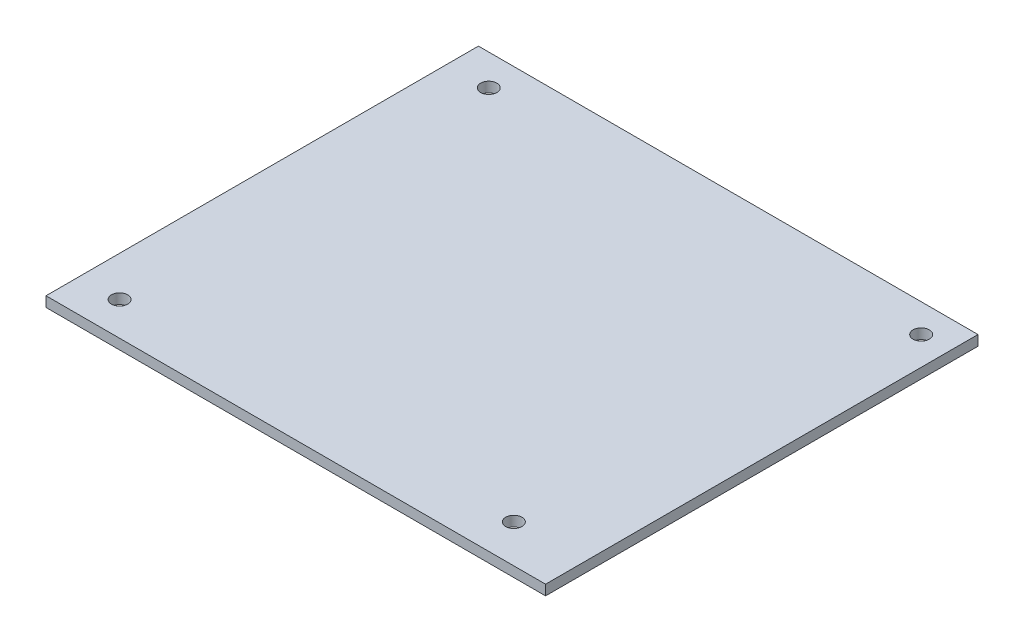
ISO-10303-21;
HEADER;
FILE_DESCRIPTION(('STEP AP214'),'2;1');
FILE_NAME('part.step','',(''),(''),'','','');
FILE_SCHEMA(('AUTOMOTIVE_DESIGN { 1 0 10303 214 1 1 1 1 }'));
ENDSEC;
DATA;
#1=APPLICATION_CONTEXT('core data for automotive mechanical design processes');
#2=APPLICATION_PROTOCOL_DEFINITION('international standard','automotive_design',2000,#1);
#3=PRODUCT_CONTEXT('',#1,'mechanical');
#4=PRODUCT('Part','Part','',(#3));
#5=PRODUCT_RELATED_PRODUCT_CATEGORY('part','',(#4));
#6=PRODUCT_DEFINITION_FORMATION('','',#4);
#7=PRODUCT_DEFINITION_CONTEXT('part definition',#1,'design');
#8=PRODUCT_DEFINITION('design','',#6,#7);
#9=PRODUCT_DEFINITION_SHAPE('','',#8);
#10=(LENGTH_UNIT() NAMED_UNIT(*) SI_UNIT(.MILLI.,.METRE.));
#11=(NAMED_UNIT(*) PLANE_ANGLE_UNIT() SI_UNIT($,.RADIAN.));
#12=(NAMED_UNIT(*) SI_UNIT($,.STERADIAN.) SOLID_ANGLE_UNIT());
#13=UNCERTAINTY_MEASURE_WITH_UNIT(LENGTH_MEASURE(1.E-05),#10,'distance_accuracy_value','');
#14=(GEOMETRIC_REPRESENTATION_CONTEXT(3) GLOBAL_UNCERTAINTY_ASSIGNED_CONTEXT((#13)) GLOBAL_UNIT_ASSIGNED_CONTEXT((#10,
#11,#12)) REPRESENTATION_CONTEXT('',''));
#15=CARTESIAN_POINT('',(0.,0.,0.));
#16=DIRECTION('',(0.,0.,1.));
#17=DIRECTION('',(1.,0.,0.));
#18=AXIS2_PLACEMENT_3D('',#15,#16,#17);
#19=CARTESIAN_POINT('',(0.,2.,0.));
#20=DIRECTION('',(0.,-1.,0.));
#21=DIRECTION('',(0.,0.,-1.));
#22=AXIS2_PLACEMENT_3D('',#19,#20,#21);
#23=PLANE('',#22);
#24=DIRECTION('',(0.,0.,-1.));
#25=VECTOR('',#24,1.);
#26=CARTESIAN_POINT('',(49.149,2.,42.545));
#27=LINE('',#26,#25);
#28=CARTESIAN_POINT('',(49.149,2.,42.545));
#29=VERTEX_POINT('',#28);
#30=CARTESIAN_POINT('',(49.149,2.,-42.545));
#31=VERTEX_POINT('',#30);
#32=EDGE_CURVE('E92',#29,#31,#27,.T.);
#33=ORIENTED_EDGE('',*,*,#32,.T.);
#34=DIRECTION('',(-1.,0.,0.));
#35=VECTOR('',#34,1.);
#36=CARTESIAN_POINT('',(-49.149,2.,-42.545));
#37=LINE('',#36,#35);
#38=CARTESIAN_POINT('',(-49.149,2.,-42.545));
#39=VERTEX_POINT('',#38);
#40=EDGE_CURVE('E87',#31,#39,#37,.T.);
#41=ORIENTED_EDGE('',*,*,#40,.T.);
#42=DIRECTION('',(0.,0.,1.));
#43=VECTOR('',#42,1.);
#44=CARTESIAN_POINT('',(-49.149,2.,42.545));
#45=LINE('',#44,#43);
#46=CARTESIAN_POINT('',(-49.149,2.,42.545));
#47=VERTEX_POINT('',#46);
#48=EDGE_CURVE('E90',#39,#47,#45,.T.);
#49=ORIENTED_EDGE('',*,*,#48,.T.);
#50=DIRECTION('',(1.,0.,0.));
#51=VECTOR('',#50,1.);
#52=CARTESIAN_POINT('',(-49.149,2.,42.545));
#53=LINE('',#52,#51);
#54=EDGE_CURVE('E57',#47,#29,#53,.T.);
#55=ORIENTED_EDGE('',*,*,#54,.T.);
#56=EDGE_LOOP('',(#33,#41,#49,#55));
#57=FACE_BOUND('',#56,.T.);
#58=CARTESIAN_POINT('',(-41.021,2.,-36.449));
#59=DIRECTION('',(0.,1.,0.));
#60=DIRECTION('',(0.,0.,1.));
#61=AXIS2_PLACEMENT_3D('',#58,#59,#60);
#62=CIRCLE('',#61,1.6);
#63=CARTESIAN_POINT('',(-41.021,2.,-34.849));
#64=VERTEX_POINT('',#63);
#65=EDGE_CURVE('E112',#64,#64,#62,.T.);
#66=ORIENTED_EDGE('',*,*,#65,.F.);
#67=EDGE_LOOP('',(#66));
#68=FACE_BOUND('',#67,.T.);
#69=CARTESIAN_POINT('',(43.561,2.,-36.957));
#70=DIRECTION('',(0.,1.,0.));
#71=DIRECTION('',(0.,0.,1.));
#72=AXIS2_PLACEMENT_3D('',#69,#70,#71);
#73=CIRCLE('',#72,1.6);
#74=CARTESIAN_POINT('',(43.561,2.,-35.357));
#75=VERTEX_POINT('',#74);
#76=EDGE_CURVE('E134',#75,#75,#73,.T.);
#77=ORIENTED_EDGE('',*,*,#76,.F.);
#78=EDGE_LOOP('',(#77));
#79=FACE_BOUND('',#78,.T.);
#80=CARTESIAN_POINT('',(35.414566569582,2.,35.0573237215337));
#81=DIRECTION('',(0.,1.,0.));
#82=DIRECTION('',(0.,0.,1.));
#83=AXIS2_PLACEMENT_3D('',#80,#81,#82);
#84=CIRCLE('',#83,1.6);
#85=CARTESIAN_POINT('',(35.414566569582,2.,36.6573237215337));
#86=VERTEX_POINT('',#85);
#87=EDGE_CURVE('E142',#86,#86,#84,.T.);
#88=ORIENTED_EDGE('',*,*,#87,.F.);
#89=EDGE_LOOP('',(#88));
#90=FACE_BOUND('',#89,.T.);
#91=CARTESIAN_POINT('',(-41.275,2.,35.941));
#92=DIRECTION('',(0.,1.,0.));
#93=DIRECTION('',(0.,0.,1.));
#94=AXIS2_PLACEMENT_3D('',#91,#92,#93);
#95=CIRCLE('',#94,1.6);
#96=CARTESIAN_POINT('',(-41.275,2.,37.541));
#97=VERTEX_POINT('',#96);
#98=EDGE_CURVE('E150',#97,#97,#95,.T.);
#99=ORIENTED_EDGE('',*,*,#98,.F.);
#100=EDGE_LOOP('',(#99));
#101=FACE_BOUND('',#100,.T.);
#102=ADVANCED_FACE('F39',(#57,#68,#79,#90,#101),#23,.F.);
#103=CARTESIAN_POINT('',(0.,0.,0.));
#104=DIRECTION('',(0.,-1.,0.));
#105=DIRECTION('',(0.,0.,-1.));
#106=AXIS2_PLACEMENT_3D('',#103,#104,#105);
#107=PLANE('',#106);
#108=CARTESIAN_POINT('',(35.414566569582,0.,35.0573237215337));
#109=DIRECTION('',(0.,1.,0.));
#110=DIRECTION('',(0.,0.,1.));
#111=AXIS2_PLACEMENT_3D('',#108,#109,#110);
#112=CIRCLE('',#111,1.6);
#113=CARTESIAN_POINT('',(35.414566569582,0.,36.6573237215337));
#114=VERTEX_POINT('',#113);
#115=EDGE_CURVE('E146',#114,#114,#112,.T.);
#116=ORIENTED_EDGE('',*,*,#115,.T.);
#117=EDGE_LOOP('',(#116));
#118=FACE_BOUND('',#117,.T.);
#119=CARTESIAN_POINT('',(-41.021,0.,-36.449));
#120=DIRECTION('',(0.,1.,0.));
#121=DIRECTION('',(0.,0.,1.));
#122=AXIS2_PLACEMENT_3D('',#119,#120,#121);
#123=CIRCLE('',#122,1.6);
#124=CARTESIAN_POINT('',(-41.021,0.,-34.849));
#125=VERTEX_POINT('',#124);
#126=EDGE_CURVE('E130',#125,#125,#123,.T.);
#127=ORIENTED_EDGE('',*,*,#126,.T.);
#128=EDGE_LOOP('',(#127));
#129=FACE_BOUND('',#128,.T.);
#130=DIRECTION('',(0.,0.,-1.));
#131=VECTOR('',#130,1.);
#132=CARTESIAN_POINT('',(49.149,0.,42.545));
#133=LINE('',#132,#131);
#134=CARTESIAN_POINT('',(49.149,0.,42.545));
#135=VERTEX_POINT('',#134);
#136=CARTESIAN_POINT('',(49.149,0.,-42.545));
#137=VERTEX_POINT('',#136);
#138=EDGE_CURVE('E108',#135,#137,#133,.T.);
#139=ORIENTED_EDGE('',*,*,#138,.F.);
#140=DIRECTION('',(1.,0.,0.));
#141=VECTOR('',#140,1.);
#142=CARTESIAN_POINT('',(-49.149,0.,42.545));
#143=LINE('',#142,#141);
#144=CARTESIAN_POINT('',(-49.149,0.,42.545));
#145=VERTEX_POINT('',#144);
#146=EDGE_CURVE('E80',#145,#135,#143,.T.);
#147=ORIENTED_EDGE('',*,*,#146,.F.);
#148=DIRECTION('',(0.,0.,1.));
#149=VECTOR('',#148,1.);
#150=CARTESIAN_POINT('',(-49.149,0.,42.545));
#151=LINE('',#150,#149);
#152=CARTESIAN_POINT('',(-49.149,0.,-42.545));
#153=VERTEX_POINT('',#152);
#154=EDGE_CURVE('E74',#153,#145,#151,.T.);
#155=ORIENTED_EDGE('',*,*,#154,.F.);
#156=DIRECTION('',(-1.,0.,0.));
#157=VECTOR('',#156,1.);
#158=CARTESIAN_POINT('',(-49.149,0.,-42.545));
#159=LINE('',#158,#157);
#160=EDGE_CURVE('E97',#137,#153,#159,.T.);
#161=ORIENTED_EDGE('',*,*,#160,.F.);
#162=EDGE_LOOP('',(#139,#147,#155,#161));
#163=FACE_BOUND('',#162,.T.);
#164=CARTESIAN_POINT('',(43.561,0.,-36.957));
#165=DIRECTION('',(0.,1.,0.));
#166=DIRECTION('',(0.,0.,1.));
#167=AXIS2_PLACEMENT_3D('',#164,#165,#166);
#168=CIRCLE('',#167,1.6);
#169=CARTESIAN_POINT('',(43.561,0.,-35.357));
#170=VERTEX_POINT('',#169);
#171=EDGE_CURVE('E138',#170,#170,#168,.T.);
#172=ORIENTED_EDGE('',*,*,#171,.T.);
#173=EDGE_LOOP('',(#172));
#174=FACE_BOUND('',#173,.T.);
#175=CARTESIAN_POINT('',(-41.275,0.,35.941));
#176=DIRECTION('',(0.,1.,0.));
#177=DIRECTION('',(0.,0.,1.));
#178=AXIS2_PLACEMENT_3D('',#175,#176,#177);
#179=CIRCLE('',#178,1.6);
#180=CARTESIAN_POINT('',(-41.275,0.,37.541));
#181=VERTEX_POINT('',#180);
#182=EDGE_CURVE('E154',#181,#181,#179,.T.);
#183=ORIENTED_EDGE('',*,*,#182,.T.);
#184=EDGE_LOOP('',(#183));
#185=FACE_BOUND('',#184,.T.);
#186=ADVANCED_FACE('F125',(#118,#129,#163,#174,#185),#107,.T.);
#187=CARTESIAN_POINT('',(49.149,2.,42.545));
#188=DIRECTION('',(-1.,0.,0.));
#189=DIRECTION('',(0.,0.,1.));
#190=AXIS2_PLACEMENT_3D('',#187,#188,#189);
#191=PLANE('',#190);
#192=ORIENTED_EDGE('',*,*,#138,.T.);
#193=DIRECTION('',(0.,-1.,0.));
#194=VECTOR('',#193,1.);
#195=CARTESIAN_POINT('',(49.149,2.,-42.545));
#196=LINE('',#195,#194);
#197=EDGE_CURVE('E11',#31,#137,#196,.T.);
#198=ORIENTED_EDGE('',*,*,#197,.F.);
#199=ORIENTED_EDGE('',*,*,#32,.F.);
#200=DIRECTION('',(0.,-1.,0.));
#201=VECTOR('',#200,1.);
#202=CARTESIAN_POINT('',(49.149,2.,42.545));
#203=LINE('',#202,#201);
#204=EDGE_CURVE('E104',#29,#135,#203,.T.);
#205=ORIENTED_EDGE('',*,*,#204,.T.);
#206=EDGE_LOOP('',(#192,#198,#199,#205));
#207=FACE_BOUND('',#206,.T.);
#208=ADVANCED_FACE('F41',(#207),#191,.F.);
#209=CARTESIAN_POINT('',(-49.149,2.,-42.545));
#210=DIRECTION('',(0.,0.,1.));
#211=DIRECTION('',(1.,0.,0.));
#212=AXIS2_PLACEMENT_3D('',#209,#210,#211);
#213=PLANE('',#212);
#214=ORIENTED_EDGE('',*,*,#160,.T.);
#215=DIRECTION('',(0.,-1.,0.));
#216=VECTOR('',#215,1.);
#217=CARTESIAN_POINT('',(-49.149,2.,-42.545));
#218=LINE('',#217,#216);
#219=EDGE_CURVE('E49',#39,#153,#218,.T.);
#220=ORIENTED_EDGE('',*,*,#219,.F.);
#221=ORIENTED_EDGE('',*,*,#40,.F.);
#222=ORIENTED_EDGE('',*,*,#197,.T.);
#223=EDGE_LOOP('',(#214,#220,#221,#222));
#224=FACE_BOUND('',#223,.T.);
#225=ADVANCED_FACE('F96',(#224),#213,.F.);
#226=CARTESIAN_POINT('',(-49.149,2.,42.545));
#227=DIRECTION('',(1.,0.,0.));
#228=DIRECTION('',(0.,0.,-1.));
#229=AXIS2_PLACEMENT_3D('',#226,#227,#228);
#230=PLANE('',#229);
#231=ORIENTED_EDGE('',*,*,#154,.T.);
#232=DIRECTION('',(0.,-1.,0.));
#233=VECTOR('',#232,1.);
#234=CARTESIAN_POINT('',(-49.149,2.,42.545));
#235=LINE('',#234,#233);
#236=EDGE_CURVE('E99',#47,#145,#235,.T.);
#237=ORIENTED_EDGE('',*,*,#236,.F.);
#238=ORIENTED_EDGE('',*,*,#48,.F.);
#239=ORIENTED_EDGE('',*,*,#219,.T.);
#240=EDGE_LOOP('',(#231,#237,#238,#239));
#241=FACE_BOUND('',#240,.T.);
#242=ADVANCED_FACE('F100',(#241),#230,.F.);
#243=CARTESIAN_POINT('',(-49.149,2.,42.545));
#244=DIRECTION('',(0.,0.,-1.));
#245=DIRECTION('',(-1.,0.,0.));
#246=AXIS2_PLACEMENT_3D('',#243,#244,#245);
#247=PLANE('',#246);
#248=ORIENTED_EDGE('',*,*,#146,.T.);
#249=ORIENTED_EDGE('',*,*,#204,.F.);
#250=ORIENTED_EDGE('',*,*,#54,.F.);
#251=ORIENTED_EDGE('',*,*,#236,.T.);
#252=EDGE_LOOP('',(#248,#249,#250,#251));
#253=FACE_BOUND('',#252,.T.);
#254=ADVANCED_FACE('F122',(#253),#247,.F.);
#255=CARTESIAN_POINT('',(-41.021,2.,-36.449));
#256=DIRECTION('',(0.,-1.,0.));
#257=DIRECTION('',(0.,0.,-1.));
#258=AXIS2_PLACEMENT_3D('',#255,#256,#257);
#259=CYLINDRICAL_SURFACE('',#258,1.6);
#260=ORIENTED_EDGE('',*,*,#65,.T.);
#261=EDGE_LOOP('',(#260));
#262=FACE_BOUND('',#261,.T.);
#263=ORIENTED_EDGE('',*,*,#126,.F.);
#264=EDGE_LOOP('',(#263));
#265=FACE_BOUND('',#264,.T.);
#266=ADVANCED_FACE('F173',(#262,#265),#259,.F.);
#267=CARTESIAN_POINT('',(43.561,2.,-36.957));
#268=DIRECTION('',(0.,-1.,0.));
#269=DIRECTION('',(0.,0.,-1.));
#270=AXIS2_PLACEMENT_3D('',#267,#268,#269);
#271=CYLINDRICAL_SURFACE('',#270,1.6);
#272=ORIENTED_EDGE('',*,*,#76,.T.);
#273=EDGE_LOOP('',(#272));
#274=FACE_BOUND('',#273,.T.);
#275=ORIENTED_EDGE('',*,*,#171,.F.);
#276=EDGE_LOOP('',(#275));
#277=FACE_BOUND('',#276,.T.);
#278=ADVANCED_FACE('F219',(#274,#277),#271,.F.);
#279=CARTESIAN_POINT('',(35.414566569582,2.,35.0573237215337));
#280=DIRECTION('',(0.,-1.,0.));
#281=DIRECTION('',(0.,0.,-1.));
#282=AXIS2_PLACEMENT_3D('',#279,#280,#281);
#283=CYLINDRICAL_SURFACE('',#282,1.6);
#284=ORIENTED_EDGE('',*,*,#87,.T.);
#285=EDGE_LOOP('',(#284));
#286=FACE_BOUND('',#285,.T.);
#287=ORIENTED_EDGE('',*,*,#115,.F.);
#288=EDGE_LOOP('',(#287));
#289=FACE_BOUND('',#288,.T.);
#290=ADVANCED_FACE('F227',(#286,#289),#283,.F.);
#291=CARTESIAN_POINT('',(-41.275,2.,35.941));
#292=DIRECTION('',(0.,-1.,0.));
#293=DIRECTION('',(0.,0.,-1.));
#294=AXIS2_PLACEMENT_3D('',#291,#292,#293);
#295=CYLINDRICAL_SURFACE('',#294,1.6);
#296=ORIENTED_EDGE('',*,*,#98,.T.);
#297=EDGE_LOOP('',(#296));
#298=FACE_BOUND('',#297,.T.);
#299=ORIENTED_EDGE('',*,*,#182,.F.);
#300=EDGE_LOOP('',(#299));
#301=FACE_BOUND('',#300,.T.);
#302=ADVANCED_FACE('F162',(#298,#301),#295,.F.);
#303=CLOSED_SHELL('',(#102,#186,#208,#225,#242,#254,#266,#278,#290,#302));
#304=MANIFOLD_SOLID_BREP('B2',#303);
#305=ADVANCED_BREP_SHAPE_REPRESENTATION('',(#18,#304),#14);
#306=SHAPE_DEFINITION_REPRESENTATION(#9,#305);
ENDSEC;
END-ISO-10303-21;
